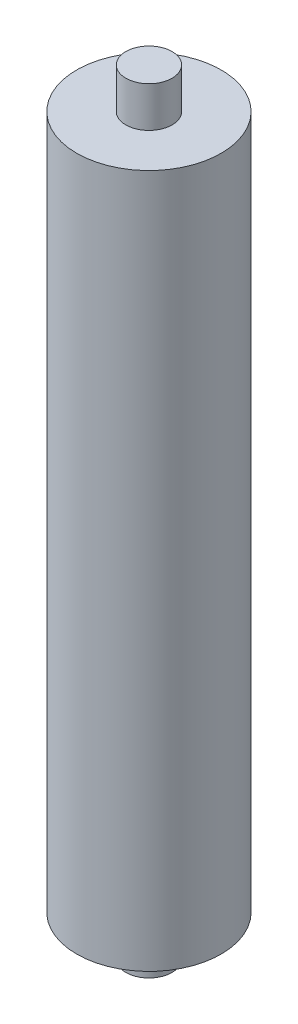
ISO-10303-21;
HEADER;
FILE_DESCRIPTION(('STEP AP214'),'2;1');
FILE_NAME('part.step','',(''),(''),'','','');
FILE_SCHEMA(('AUTOMOTIVE_DESIGN { 1 0 10303 214 1 1 1 1 }'));
ENDSEC;
DATA;
#1=APPLICATION_CONTEXT('core data for automotive mechanical design processes');
#2=APPLICATION_PROTOCOL_DEFINITION('international standard','automotive_design',2000,#1);
#3=PRODUCT_CONTEXT('',#1,'mechanical');
#4=PRODUCT('Part','Part','',(#3));
#5=PRODUCT_RELATED_PRODUCT_CATEGORY('part','',(#4));
#6=PRODUCT_DEFINITION_FORMATION('','',#4);
#7=PRODUCT_DEFINITION_CONTEXT('part definition',#1,'design');
#8=PRODUCT_DEFINITION('design','',#6,#7);
#9=PRODUCT_DEFINITION_SHAPE('','',#8);
#10=(LENGTH_UNIT() NAMED_UNIT(*) SI_UNIT(.MILLI.,.METRE.));
#11=(NAMED_UNIT(*) PLANE_ANGLE_UNIT() SI_UNIT($,.RADIAN.));
#12=(NAMED_UNIT(*) SI_UNIT($,.STERADIAN.) SOLID_ANGLE_UNIT());
#13=UNCERTAINTY_MEASURE_WITH_UNIT(LENGTH_MEASURE(1.E-05),#10,'distance_accuracy_value','');
#14=(GEOMETRIC_REPRESENTATION_CONTEXT(3) GLOBAL_UNCERTAINTY_ASSIGNED_CONTEXT((#13)) GLOBAL_UNIT_ASSIGNED_CONTEXT((#10,
#11,#12)) REPRESENTATION_CONTEXT('',''));
#15=CARTESIAN_POINT('',(0.,0.,0.));
#16=DIRECTION('',(0.,0.,1.));
#17=DIRECTION('',(1.,0.,0.));
#18=AXIS2_PLACEMENT_3D('',#15,#16,#17);
#19=CARTESIAN_POINT('',(0.,-60.,0.));
#20=DIRECTION('',(0.,1.,0.));
#21=DIRECTION('',(0.,0.,1.));
#22=AXIS2_PLACEMENT_3D('',#19,#20,#21);
#23=CYLINDRICAL_SURFACE('',#22,12.5);
#24=CARTESIAN_POINT('',(0.,-60.,0.));
#25=DIRECTION('',(0.,1.,0.));
#26=DIRECTION('',(0.,0.,1.));
#27=AXIS2_PLACEMENT_3D('',#24,#25,#26);
#28=CIRCLE('',#27,12.5);
#29=CARTESIAN_POINT('',(0.,-60.,12.5));
#30=VERTEX_POINT('',#29);
#31=EDGE_CURVE('E41',#30,#30,#28,.T.);
#32=ORIENTED_EDGE('',*,*,#31,.T.);
#33=EDGE_LOOP('',(#32));
#34=FACE_BOUND('',#33,.T.);
#35=CARTESIAN_POINT('',(0.,60.,0.));
#36=DIRECTION('',(0.,1.,0.));
#37=DIRECTION('',(0.,0.,1.));
#38=AXIS2_PLACEMENT_3D('',#35,#36,#37);
#39=CIRCLE('',#38,12.5);
#40=CARTESIAN_POINT('',(0.,60.,12.5));
#41=VERTEX_POINT('',#40);
#42=EDGE_CURVE('E45',#41,#41,#39,.T.);
#43=ORIENTED_EDGE('',*,*,#42,.F.);
#44=EDGE_LOOP('',(#43));
#45=FACE_BOUND('',#44,.T.);
#46=ADVANCED_FACE('F35',(#34,#45),#23,.T.);
#47=CARTESIAN_POINT('',(0.,-60.,0.));
#48=DIRECTION('',(0.,1.,0.));
#49=DIRECTION('',(0.,0.,1.));
#50=AXIS2_PLACEMENT_3D('',#47,#48,#49);
#51=PLANE('',#50);
#52=CARTESIAN_POINT('',(0.,-60.,0.));
#53=DIRECTION('',(0.,1.,0.));
#54=DIRECTION('',(0.,0.,1.));
#55=AXIS2_PLACEMENT_3D('',#52,#53,#54);
#56=CIRCLE('',#55,4.);
#57=CARTESIAN_POINT('',(0.,-60.,4.));
#58=VERTEX_POINT('',#57);
#59=EDGE_CURVE('E10',#58,#58,#56,.F.);
#60=ORIENTED_EDGE('',*,*,#59,.F.);
#61=EDGE_LOOP('',(#60));
#62=FACE_BOUND('',#61,.T.);
#63=ORIENTED_EDGE('',*,*,#31,.F.);
#64=EDGE_LOOP('',(#63));
#65=FACE_BOUND('',#64,.T.);
#66=ADVANCED_FACE('F76',(#62,#65),#51,.F.);
#67=CARTESIAN_POINT('',(0.,60.,0.));
#68=DIRECTION('',(0.,1.,0.));
#69=DIRECTION('',(0.,0.,1.));
#70=AXIS2_PLACEMENT_3D('',#67,#68,#69);
#71=PLANE('',#70);
#72=CARTESIAN_POINT('',(0.,60.,0.));
#73=DIRECTION('',(0.,1.,0.));
#74=DIRECTION('',(0.,0.,1.));
#75=AXIS2_PLACEMENT_3D('',#72,#73,#74);
#76=CIRCLE('',#75,4.);
#77=CARTESIAN_POINT('',(0.,60.,4.));
#78=VERTEX_POINT('',#77);
#79=EDGE_CURVE('E52',#78,#78,#76,.T.);
#80=ORIENTED_EDGE('',*,*,#79,.F.);
#81=EDGE_LOOP('',(#80));
#82=FACE_BOUND('',#81,.T.);
#83=ORIENTED_EDGE('',*,*,#42,.T.);
#84=EDGE_LOOP('',(#83));
#85=FACE_BOUND('',#84,.T.);
#86=ADVANCED_FACE('F80',(#82,#85),#71,.T.);
#87=CARTESIAN_POINT('',(0.,67.,0.));
#88=DIRECTION('',(0.,-1.,0.));
#89=DIRECTION('',(0.,0.,-1.));
#90=AXIS2_PLACEMENT_3D('',#87,#88,#89);
#91=CYLINDRICAL_SURFACE('',#90,4.);
#92=CARTESIAN_POINT('',(0.,67.,0.));
#93=DIRECTION('',(0.,1.,0.));
#94=DIRECTION('',(0.,0.,1.));
#95=AXIS2_PLACEMENT_3D('',#92,#93,#94);
#96=CIRCLE('',#95,4.);
#97=CARTESIAN_POINT('',(0.,67.,4.));
#98=VERTEX_POINT('',#97);
#99=EDGE_CURVE('E49',#98,#98,#96,.T.);
#100=ORIENTED_EDGE('',*,*,#99,.F.);
#101=EDGE_LOOP('',(#100));
#102=FACE_BOUND('',#101,.T.);
#103=ORIENTED_EDGE('',*,*,#79,.T.);
#104=EDGE_LOOP('',(#103));
#105=FACE_BOUND('',#104,.T.);
#106=ADVANCED_FACE('F72',(#102,#105),#91,.T.);
#107=CARTESIAN_POINT('',(0.,67.,0.));
#108=DIRECTION('',(0.,1.,0.));
#109=DIRECTION('',(0.,0.,1.));
#110=AXIS2_PLACEMENT_3D('',#107,#108,#109);
#111=PLANE('',#110);
#112=ORIENTED_EDGE('',*,*,#99,.T.);
#113=EDGE_LOOP('',(#112));
#114=FACE_BOUND('',#113,.T.);
#115=ADVANCED_FACE('F65',(#114),#111,.T.);
#116=CARTESIAN_POINT('',(0.,-67.,0.));
#117=DIRECTION('',(0.,1.,0.));
#118=DIRECTION('',(0.,0.,1.));
#119=AXIS2_PLACEMENT_3D('',#116,#117,#118);
#120=CYLINDRICAL_SURFACE('',#119,4.);
#121=CARTESIAN_POINT('',(0.,-67.,0.));
#122=DIRECTION('',(0.,-1.,0.));
#123=DIRECTION('',(0.,0.,-1.));
#124=AXIS2_PLACEMENT_3D('',#121,#122,#123);
#125=CIRCLE('',#124,4.);
#126=CARTESIAN_POINT('',(0.,-67.,-4.));
#127=VERTEX_POINT('',#126);
#128=EDGE_CURVE('E55',#127,#127,#125,.T.);
#129=ORIENTED_EDGE('',*,*,#128,.F.);
#130=EDGE_LOOP('',(#129));
#131=FACE_BOUND('',#130,.T.);
#132=ORIENTED_EDGE('',*,*,#59,.T.);
#133=EDGE_LOOP('',(#132));
#134=FACE_BOUND('',#133,.T.);
#135=ADVANCED_FACE('F63',(#131,#134),#120,.T.);
#136=CARTESIAN_POINT('',(0.,-67.,0.));
#137=DIRECTION('',(0.,-1.,0.));
#138=DIRECTION('',(0.,0.,-1.));
#139=AXIS2_PLACEMENT_3D('',#136,#137,#138);
#140=PLANE('',#139);
#141=ORIENTED_EDGE('',*,*,#128,.T.);
#142=EDGE_LOOP('',(#141));
#143=FACE_BOUND('',#142,.T.);
#144=ADVANCED_FACE('F61',(#143),#140,.T.);
#145=CLOSED_SHELL('',(#46,#66,#86,#106,#115,#135,#144));
#146=MANIFOLD_SOLID_BREP('B2',#145);
#147=ADVANCED_BREP_SHAPE_REPRESENTATION('',(#18,#146),#14);
#148=SHAPE_DEFINITION_REPRESENTATION(#9,#147);
ENDSEC;
END-ISO-10303-21;
